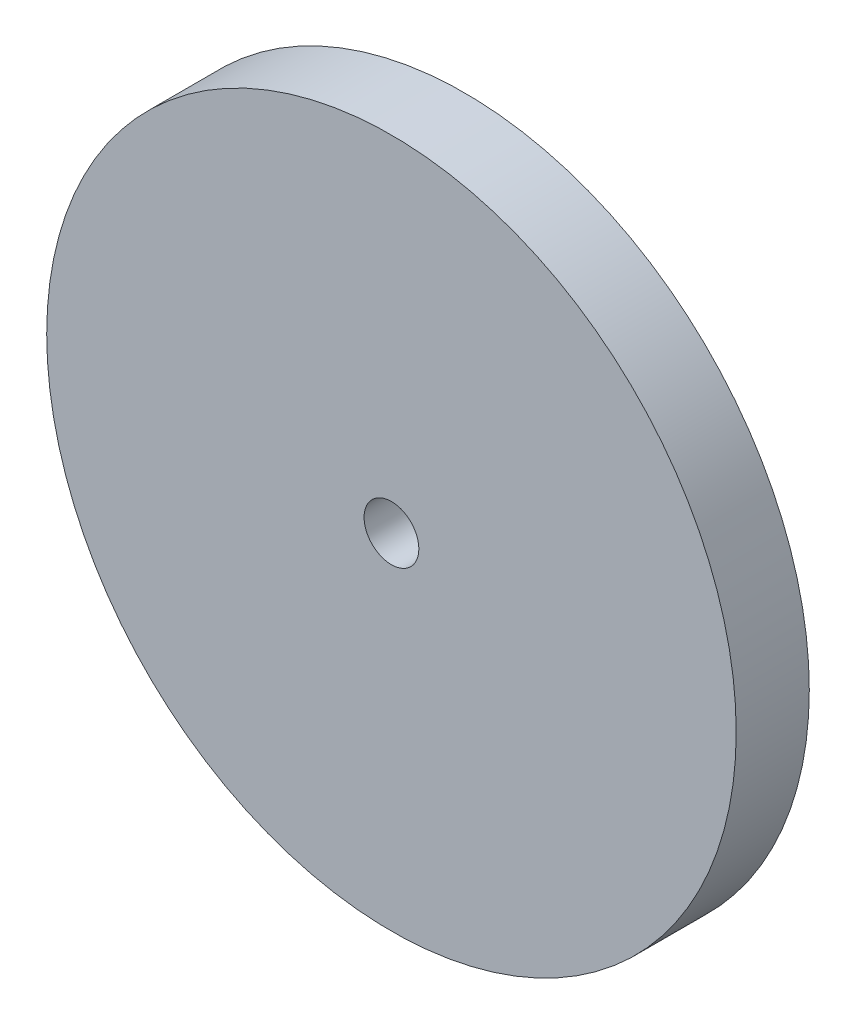
ISO-10303-21;
HEADER;
FILE_DESCRIPTION(('STEP AP214'),'2;1');
FILE_NAME('part.step','',(''),(''),'','','');
FILE_SCHEMA(('AUTOMOTIVE_DESIGN { 1 0 10303 214 1 1 1 1 }'));
ENDSEC;
DATA;
#1=APPLICATION_CONTEXT('core data for automotive mechanical design processes');
#2=APPLICATION_PROTOCOL_DEFINITION('international standard','automotive_design',2000,#1);
#3=PRODUCT_CONTEXT('',#1,'mechanical');
#4=PRODUCT('Part','Part','',(#3));
#5=PRODUCT_RELATED_PRODUCT_CATEGORY('part','',(#4));
#6=PRODUCT_DEFINITION_FORMATION('','',#4);
#7=PRODUCT_DEFINITION_CONTEXT('part definition',#1,'design');
#8=PRODUCT_DEFINITION('design','',#6,#7);
#9=PRODUCT_DEFINITION_SHAPE('','',#8);
#10=(LENGTH_UNIT() NAMED_UNIT(*) SI_UNIT(.MILLI.,.METRE.));
#11=(NAMED_UNIT(*) PLANE_ANGLE_UNIT() SI_UNIT($,.RADIAN.));
#12=(NAMED_UNIT(*) SI_UNIT($,.STERADIAN.) SOLID_ANGLE_UNIT());
#13=UNCERTAINTY_MEASURE_WITH_UNIT(LENGTH_MEASURE(1.E-05),#10,'distance_accuracy_value','');
#14=(GEOMETRIC_REPRESENTATION_CONTEXT(3) GLOBAL_UNCERTAINTY_ASSIGNED_CONTEXT((#13)) GLOBAL_UNIT_ASSIGNED_CONTEXT((#10,
#11,#12)) REPRESENTATION_CONTEXT('',''));
#15=CARTESIAN_POINT('',(0.,0.,0.));
#16=DIRECTION('',(0.,0.,1.));
#17=DIRECTION('',(1.,0.,0.));
#18=AXIS2_PLACEMENT_3D('',#15,#16,#17);
#19=CARTESIAN_POINT('',(0.,0.,6.));
#20=DIRECTION('',(0.,0.,-1.));
#21=DIRECTION('',(-1.,0.,0.));
#22=AXIS2_PLACEMENT_3D('',#19,#20,#21);
#23=CYLINDRICAL_SURFACE('',#22,28.3);
#24=CARTESIAN_POINT('',(0.,0.,6.));
#25=DIRECTION('',(0.,0.,1.));
#26=DIRECTION('',(1.,0.,0.));
#27=AXIS2_PLACEMENT_3D('',#24,#25,#26);
#28=CIRCLE('',#27,28.3);
#29=CARTESIAN_POINT('',(28.3,0.,6.));
#30=VERTEX_POINT('',#29);
#31=EDGE_CURVE('E10',#30,#30,#28,.T.);
#32=ORIENTED_EDGE('',*,*,#31,.F.);
#33=EDGE_LOOP('',(#32));
#34=FACE_BOUND('',#33,.T.);
#35=CARTESIAN_POINT('',(0.,0.,0.));
#36=DIRECTION('',(0.,0.,1.));
#37=DIRECTION('',(1.,0.,0.));
#38=AXIS2_PLACEMENT_3D('',#35,#36,#37);
#39=CIRCLE('',#38,28.3);
#40=CARTESIAN_POINT('',(28.3,0.,0.));
#41=VERTEX_POINT('',#40);
#42=EDGE_CURVE('E32',#41,#41,#39,.T.);
#43=ORIENTED_EDGE('',*,*,#42,.T.);
#44=EDGE_LOOP('',(#43));
#45=FACE_BOUND('',#44,.T.);
#46=ADVANCED_FACE('F29',(#34,#45),#23,.T.);
#47=CARTESIAN_POINT('',(0.,0.,6.));
#48=DIRECTION('',(0.,0.,1.));
#49=DIRECTION('',(1.,0.,0.));
#50=AXIS2_PLACEMENT_3D('',#47,#48,#49);
#51=PLANE('',#50);
#52=CARTESIAN_POINT('',(0.,0.,6.));
#53=DIRECTION('',(0.,0.,1.));
#54=DIRECTION('',(1.,0.,0.));
#55=AXIS2_PLACEMENT_3D('',#52,#53,#54);
#56=CIRCLE('',#55,2.24789999999999);
#57=CARTESIAN_POINT('',(2.24789999999999,0.,6.));
#58=VERTEX_POINT('',#57);
#59=EDGE_CURVE('E43',#58,#58,#56,.T.);
#60=ORIENTED_EDGE('',*,*,#59,.F.);
#61=EDGE_LOOP('',(#60));
#62=FACE_BOUND('',#61,.T.);
#63=ORIENTED_EDGE('',*,*,#31,.T.);
#64=EDGE_LOOP('',(#63));
#65=FACE_BOUND('',#64,.T.);
#66=ADVANCED_FACE('F49',(#62,#65),#51,.T.);
#67=CARTESIAN_POINT('',(0.,0.,0.));
#68=DIRECTION('',(0.,0.,1.));
#69=DIRECTION('',(1.,0.,0.));
#70=AXIS2_PLACEMENT_3D('',#67,#68,#69);
#71=PLANE('',#70);
#72=CARTESIAN_POINT('',(0.,0.,0.));
#73=DIRECTION('',(0.,0.,1.));
#74=DIRECTION('',(1.,0.,0.));
#75=AXIS2_PLACEMENT_3D('',#72,#73,#74);
#76=CIRCLE('',#75,2.2479);
#77=CARTESIAN_POINT('',(2.2479,0.,0.));
#78=VERTEX_POINT('',#77);
#79=EDGE_CURVE('E39',#78,#78,#76,.T.);
#80=ORIENTED_EDGE('',*,*,#79,.T.);
#81=EDGE_LOOP('',(#80));
#82=FACE_BOUND('',#81,.T.);
#83=ORIENTED_EDGE('',*,*,#42,.F.);
#84=EDGE_LOOP('',(#83));
#85=FACE_BOUND('',#84,.T.);
#86=ADVANCED_FACE('F51',(#82,#85),#71,.F.);
#87=CARTESIAN_POINT('',(0.,0.,6.));
#88=DIRECTION('',(0.,0.,1.));
#89=DIRECTION('',(1.,0.,0.));
#90=AXIS2_PLACEMENT_3D('',#87,#88,#89);
#91=CYLINDRICAL_SURFACE('',#90,2.24789999999999);
#92=ORIENTED_EDGE('',*,*,#79,.F.);
#93=EDGE_LOOP('',(#92));
#94=FACE_BOUND('',#93,.T.);
#95=ORIENTED_EDGE('',*,*,#59,.T.);
#96=EDGE_LOOP('',(#95));
#97=FACE_BOUND('',#96,.T.);
#98=ADVANCED_FACE('F47',(#94,#97),#91,.F.);
#99=CLOSED_SHELL('',(#46,#66,#86,#98));
#100=MANIFOLD_SOLID_BREP('B2',#99);
#101=ADVANCED_BREP_SHAPE_REPRESENTATION('',(#18,#100),#14);
#102=SHAPE_DEFINITION_REPRESENTATION(#9,#101);
ENDSEC;
END-ISO-10303-21;
